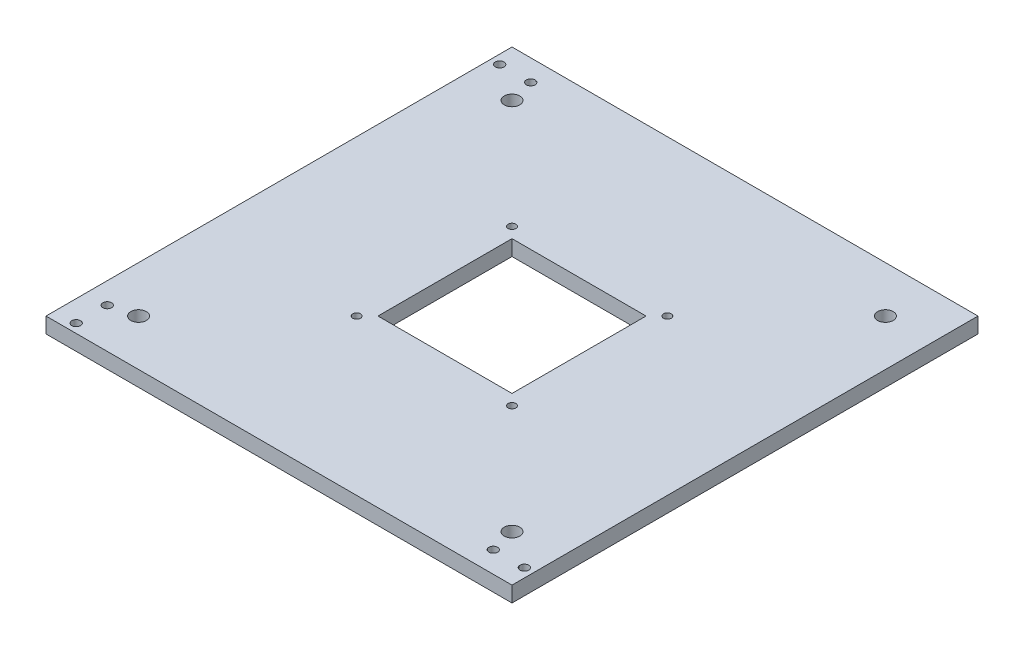
ISO-10303-21;
HEADER;
FILE_DESCRIPTION(('STEP AP214'),'2;1');
FILE_NAME('part.step','',(''),(''),'','','');
FILE_SCHEMA(('AUTOMOTIVE_DESIGN { 1 0 10303 214 1 1 1 1 }'));
ENDSEC;
DATA;
#1=APPLICATION_CONTEXT('core data for automotive mechanical design processes');
#2=APPLICATION_PROTOCOL_DEFINITION('international standard','automotive_design',2000,#1);
#3=PRODUCT_CONTEXT('',#1,'mechanical');
#4=PRODUCT('Part','Part','',(#3));
#5=PRODUCT_RELATED_PRODUCT_CATEGORY('part','',(#4));
#6=PRODUCT_DEFINITION_FORMATION('','',#4);
#7=PRODUCT_DEFINITION_CONTEXT('part definition',#1,'design');
#8=PRODUCT_DEFINITION('design','',#6,#7);
#9=PRODUCT_DEFINITION_SHAPE('','',#8);
#10=(LENGTH_UNIT() NAMED_UNIT(*) SI_UNIT(.MILLI.,.METRE.));
#11=(NAMED_UNIT(*) PLANE_ANGLE_UNIT() SI_UNIT($,.RADIAN.));
#12=(NAMED_UNIT(*) SI_UNIT($,.STERADIAN.) SOLID_ANGLE_UNIT());
#13=UNCERTAINTY_MEASURE_WITH_UNIT(LENGTH_MEASURE(1.E-05),#10,'distance_accuracy_value','');
#14=(GEOMETRIC_REPRESENTATION_CONTEXT(3) GLOBAL_UNCERTAINTY_ASSIGNED_CONTEXT((#13)) GLOBAL_UNIT_ASSIGNED_CONTEXT((#10,
#11,#12)) REPRESENTATION_CONTEXT('',''));
#15=CARTESIAN_POINT('',(0.,0.,0.));
#16=DIRECTION('',(0.,0.,1.));
#17=DIRECTION('',(1.,0.,0.));
#18=AXIS2_PLACEMENT_3D('',#15,#16,#17);
#19=CARTESIAN_POINT('',(0.,6.35,0.));
#20=DIRECTION('',(0.,1.,0.));
#21=DIRECTION('',(0.,0.,1.));
#22=AXIS2_PLACEMENT_3D('',#19,#20,#21);
#23=PLANE('',#22);
#24=CARTESIAN_POINT('',(-76.33,6.35,76.3299999999998));
#25=DIRECTION('',(0.,-1.,0.));
#26=DIRECTION('',(0.,0.,-1.));
#27=AXIS2_PLACEMENT_3D('',#24,#25,#26);
#28=CIRCLE('',#27,3.175);
#29=CARTESIAN_POINT('',(-76.33,6.35,73.1549999999998));
#30=VERTEX_POINT('',#29);
#31=EDGE_CURVE('E598',#30,#30,#28,.T.);
#32=ORIENTED_EDGE('',*,*,#31,.T.);
#33=EDGE_LOOP('',(#32));
#34=FACE_BOUND('',#33,.T.);
#35=CARTESIAN_POINT('',(-76.33,6.35,-76.3300000000002));
#36=DIRECTION('',(0.,-1.,0.));
#37=DIRECTION('',(0.,0.,-1.));
#38=AXIS2_PLACEMENT_3D('',#35,#36,#37);
#39=CIRCLE('',#38,3.175);
#40=CARTESIAN_POINT('',(-76.33,6.35,-79.5050000000002));
#41=VERTEX_POINT('',#40);
#42=EDGE_CURVE('E602',#41,#41,#39,.T.);
#43=ORIENTED_EDGE('',*,*,#42,.T.);
#44=EDGE_LOOP('',(#43));
#45=FACE_BOUND('',#44,.T.);
#46=CARTESIAN_POINT('',(76.3299999999999,6.35,76.3299999999997));
#47=DIRECTION('',(0.,-1.,0.));
#48=DIRECTION('',(0.,0.,-1.));
#49=AXIS2_PLACEMENT_3D('',#46,#47,#48);
#50=CIRCLE('',#49,3.175);
#51=CARTESIAN_POINT('',(76.3299999999999,6.35,73.1549999999997));
#52=VERTEX_POINT('',#51);
#53=EDGE_CURVE('E610',#52,#52,#50,.T.);
#54=ORIENTED_EDGE('',*,*,#53,.T.);
#55=EDGE_LOOP('',(#54));
#56=FACE_BOUND('',#55,.T.);
#57=CARTESIAN_POINT('',(76.3299999999999,6.35,-76.3300000000001));
#58=DIRECTION('',(0.,-1.,0.));
#59=DIRECTION('',(0.,0.,-1.));
#60=AXIS2_PLACEMENT_3D('',#57,#58,#59);
#61=CIRCLE('',#60,3.175);
#62=CARTESIAN_POINT('',(76.3299999999999,6.35,-79.5050000000001));
#63=VERTEX_POINT('',#62);
#64=EDGE_CURVE('E618',#63,#63,#61,.T.);
#65=ORIENTED_EDGE('',*,*,#64,.T.);
#66=EDGE_LOOP('',(#65));
#67=FACE_BOUND('',#66,.T.);
#68=CARTESIAN_POINT('',(31.7499999999999,6.35,-31.7499999999999));
#69=DIRECTION('',(0.,1.,0.));
#70=DIRECTION('',(0.,0.,1.));
#71=AXIS2_PLACEMENT_3D('',#68,#69,#70);
#72=CIRCLE('',#71,1.58749999999999);
#73=CARTESIAN_POINT('',(31.7499999999999,6.35,-30.1624999999999));
#74=VERTEX_POINT('',#73);
#75=EDGE_CURVE('E626',#74,#74,#72,.T.);
#76=ORIENTED_EDGE('',*,*,#75,.F.);
#77=EDGE_LOOP('',(#76));
#78=FACE_BOUND('',#77,.T.);
#79=CARTESIAN_POINT('',(-31.7500000000001,6.35,31.75));
#80=DIRECTION('',(0.,1.,0.));
#81=DIRECTION('',(0.,0.,1.));
#82=AXIS2_PLACEMENT_3D('',#79,#80,#81);
#83=CIRCLE('',#82,1.5875);
#84=CARTESIAN_POINT('',(-31.7500000000001,6.35,33.3375));
#85=VERTEX_POINT('',#84);
#86=EDGE_CURVE('E632',#85,#85,#83,.T.);
#87=ORIENTED_EDGE('',*,*,#86,.F.);
#88=EDGE_LOOP('',(#87));
#89=FACE_BOUND('',#88,.T.);
#90=CARTESIAN_POINT('',(-31.7500000000001,6.35,-31.75));
#91=DIRECTION('',(0.,1.,0.));
#92=DIRECTION('',(0.,0.,1.));
#93=AXIS2_PLACEMENT_3D('',#90,#91,#92);
#94=CIRCLE('',#93,1.5875);
#95=CARTESIAN_POINT('',(-31.7500000000001,6.35,-30.1625));
#96=VERTEX_POINT('',#95);
#97=EDGE_CURVE('E638',#96,#96,#94,.T.);
#98=ORIENTED_EDGE('',*,*,#97,.F.);
#99=EDGE_LOOP('',(#98));
#100=FACE_BOUND('',#99,.T.);
#101=CARTESIAN_POINT('',(31.7499999999998,6.35,31.75));
#102=DIRECTION('',(0.,1.,0.));
#103=DIRECTION('',(0.,0.,1.));
#104=AXIS2_PLACEMENT_3D('',#101,#102,#103);
#105=CIRCLE('',#104,1.58750000000001);
#106=CARTESIAN_POINT('',(31.7499999999998,6.35,33.3375));
#107=VERTEX_POINT('',#106);
#108=EDGE_CURVE('E269',#107,#107,#105,.T.);
#109=ORIENTED_EDGE('',*,*,#108,.F.);
#110=EDGE_LOOP('',(#109));
#111=FACE_BOUND('',#110,.T.);
#112=CARTESIAN_POINT('',(-91.6,6.35,-86.55));
#113=DIRECTION('',(0.,1.,0.));
#114=DIRECTION('',(0.,0.,1.));
#115=AXIS2_PLACEMENT_3D('',#112,#113,#114);
#116=CIRCLE('',#115,1.778);
#117=CARTESIAN_POINT('',(-91.6,6.35,-84.772));
#118=VERTEX_POINT('',#117);
#119=EDGE_CURVE('E291',#118,#118,#116,.T.);
#120=ORIENTED_EDGE('',*,*,#119,.F.);
#121=EDGE_LOOP('',(#120));
#122=FACE_BOUND('',#121,.T.);
#123=CARTESIAN_POINT('',(-86.55,6.35,91.6));
#124=DIRECTION('',(0.,1.,0.));
#125=DIRECTION('',(0.,0.,1.));
#126=AXIS2_PLACEMENT_3D('',#123,#124,#125);
#127=CIRCLE('',#126,1.778);
#128=CARTESIAN_POINT('',(-86.55,6.35,93.378));
#129=VERTEX_POINT('',#128);
#130=EDGE_CURVE('E303',#129,#129,#127,.T.);
#131=ORIENTED_EDGE('',*,*,#130,.F.);
#132=EDGE_LOOP('',(#131));
#133=FACE_BOUND('',#132,.T.);
#134=CARTESIAN_POINT('',(91.6,6.35,86.55));
#135=DIRECTION('',(0.,1.,0.));
#136=DIRECTION('',(0.,0.,1.));
#137=AXIS2_PLACEMENT_3D('',#134,#135,#136);
#138=CIRCLE('',#137,1.778);
#139=CARTESIAN_POINT('',(91.6,6.35,88.328));
#140=VERTEX_POINT('',#139);
#141=EDGE_CURVE('E315',#140,#140,#138,.T.);
#142=ORIENTED_EDGE('',*,*,#141,.F.);
#143=EDGE_LOOP('',(#142));
#144=FACE_BOUND('',#143,.T.);
#145=DIRECTION('',(1.,0.,0.));
#146=VECTOR('',#145,1.);
#147=CARTESIAN_POINT('',(-95.25,6.35,95.25));
#148=LINE('',#147,#146);
#149=CARTESIAN_POINT('',(-95.25,6.35,95.25));
#150=VERTEX_POINT('',#149);
#151=CARTESIAN_POINT('',(95.25,6.35,95.25));
#152=VERTEX_POINT('',#151);
#153=EDGE_CURVE('E327',#150,#152,#148,.T.);
#154=ORIENTED_EDGE('',*,*,#153,.T.);
#155=DIRECTION('',(0.,0.,-1.));
#156=VECTOR('',#155,1.);
#157=CARTESIAN_POINT('',(95.25,6.35,95.25));
#158=LINE('',#157,#156);
#159=CARTESIAN_POINT('',(95.25,6.35,-95.25));
#160=VERTEX_POINT('',#159);
#161=EDGE_CURVE('E330',#152,#160,#158,.T.);
#162=ORIENTED_EDGE('',*,*,#161,.T.);
#163=DIRECTION('',(1.,0.,0.));
#164=VECTOR('',#163,1.);
#165=CARTESIAN_POINT('',(-95.25,6.35,-95.25));
#166=LINE('',#165,#164);
#167=CARTESIAN_POINT('',(-95.25,6.35,-95.25));
#168=VERTEX_POINT('',#167);
#169=EDGE_CURVE('E333',#168,#160,#166,.T.);
#170=ORIENTED_EDGE('',*,*,#169,.F.);
#171=DIRECTION('',(0.,0.,-1.));
#172=VECTOR('',#171,1.);
#173=CARTESIAN_POINT('',(-95.25,6.35,95.25));
#174=LINE('',#173,#172);
#175=EDGE_CURVE('E336',#150,#168,#174,.T.);
#176=ORIENTED_EDGE('',*,*,#175,.F.);
#177=EDGE_LOOP('',(#154,#162,#170,#176));
#178=FACE_BOUND('',#177,.T.);
#179=CARTESIAN_POINT('',(78.9,6.35,86.55));
#180=DIRECTION('',(0.,1.,0.));
#181=DIRECTION('',(0.,0.,1.));
#182=AXIS2_PLACEMENT_3D('',#179,#180,#181);
#183=CIRCLE('',#182,1.778);
#184=CARTESIAN_POINT('',(78.9,6.35,88.328));
#185=VERTEX_POINT('',#184);
#186=EDGE_CURVE('E321',#185,#185,#183,.T.);
#187=ORIENTED_EDGE('',*,*,#186,.F.);
#188=EDGE_LOOP('',(#187));
#189=FACE_BOUND('',#188,.T.);
#190=CARTESIAN_POINT('',(-86.55,6.35,78.9));
#191=DIRECTION('',(0.,1.,0.));
#192=DIRECTION('',(0.,0.,1.));
#193=AXIS2_PLACEMENT_3D('',#190,#191,#192);
#194=CIRCLE('',#193,1.778);
#195=CARTESIAN_POINT('',(-86.55,6.35,80.678));
#196=VERTEX_POINT('',#195);
#197=EDGE_CURVE('E309',#196,#196,#194,.T.);
#198=ORIENTED_EDGE('',*,*,#197,.F.);
#199=EDGE_LOOP('',(#198));
#200=FACE_BOUND('',#199,.T.);
#201=CARTESIAN_POINT('',(-78.9,6.35,-86.55));
#202=DIRECTION('',(0.,1.,0.));
#203=DIRECTION('',(0.,0.,1.));
#204=AXIS2_PLACEMENT_3D('',#201,#202,#203);
#205=CIRCLE('',#204,1.778);
#206=CARTESIAN_POINT('',(-78.9,6.35,-84.772));
#207=VERTEX_POINT('',#206);
#208=EDGE_CURVE('E297',#207,#207,#205,.T.);
#209=ORIENTED_EDGE('',*,*,#208,.F.);
#210=EDGE_LOOP('',(#209));
#211=FACE_BOUND('',#210,.T.);
#212=DIRECTION('',(1.,0.,0.));
#213=VECTOR('',#212,1.);
#214=CARTESIAN_POINT('',(0.,6.35,-27.4));
#215=LINE('',#214,#213);
#216=CARTESIAN_POINT('',(-27.4000000000003,6.35,-27.4));
#217=VERTEX_POINT('',#216);
#218=CARTESIAN_POINT('',(27.3999999999997,6.35,-27.4));
#219=VERTEX_POINT('',#218);
#220=EDGE_CURVE('E287',#217,#219,#215,.T.);
#221=ORIENTED_EDGE('',*,*,#220,.T.);
#222=DIRECTION('',(0.,0.,1.));
#223=VECTOR('',#222,1.);
#224=CARTESIAN_POINT('',(27.3999999999997,6.35,0.));
#225=LINE('',#224,#223);
#226=CARTESIAN_POINT('',(27.3999999999997,6.35,27.4));
#227=VERTEX_POINT('',#226);
#228=EDGE_CURVE('E251',#219,#227,#225,.T.);
#229=ORIENTED_EDGE('',*,*,#228,.T.);
#230=DIRECTION('',(-1.,0.,0.));
#231=VECTOR('',#230,1.);
#232=CARTESIAN_POINT('',(0.,6.35,27.4));
#233=LINE('',#232,#231);
#234=CARTESIAN_POINT('',(-27.4000000000003,6.35,27.4));
#235=VERTEX_POINT('',#234);
#236=EDGE_CURVE('E254',#227,#235,#233,.T.);
#237=ORIENTED_EDGE('',*,*,#236,.T.);
#238=DIRECTION('',(0.,0.,-1.));
#239=VECTOR('',#238,1.);
#240=CARTESIAN_POINT('',(-27.4000000000003,6.35,0.));
#241=LINE('',#240,#239);
#242=EDGE_CURVE('E284',#235,#217,#241,.T.);
#243=ORIENTED_EDGE('',*,*,#242,.T.);
#244=EDGE_LOOP('',(#221,#229,#237,#243));
#245=FACE_BOUND('',#244,.T.);
#246=ADVANCED_FACE('F183',(#34,#45,#56,#67,#78,#89,#100,#111,#122,#133,#144,#178,#189,#200,#211,
#245),#23,.T.);
#247=CARTESIAN_POINT('',(0.,0.,0.));
#248=DIRECTION('',(0.,1.,0.));
#249=DIRECTION('',(0.,0.,1.));
#250=AXIS2_PLACEMENT_3D('',#247,#248,#249);
#251=PLANE('',#250);
#252=CARTESIAN_POINT('',(-76.33,0.,76.3299999999998));
#253=DIRECTION('',(0.,-1.,0.));
#254=DIRECTION('',(0.,0.,-1.));
#255=AXIS2_PLACEMENT_3D('',#252,#253,#254);
#256=CIRCLE('',#255,3.175);
#257=CARTESIAN_POINT('',(-76.33,0.,73.1549999999998));
#258=VERTEX_POINT('',#257);
#259=EDGE_CURVE('E601',#258,#258,#256,.T.);
#260=ORIENTED_EDGE('',*,*,#259,.F.);
#261=EDGE_LOOP('',(#260));
#262=FACE_BOUND('',#261,.T.);
#263=CARTESIAN_POINT('',(-76.33,0.,-76.3300000000002));
#264=DIRECTION('',(0.,-1.,0.));
#265=DIRECTION('',(0.,0.,-1.));
#266=AXIS2_PLACEMENT_3D('',#263,#264,#265);
#267=CIRCLE('',#266,3.175);
#268=CARTESIAN_POINT('',(-76.33,0.,-79.5050000000002));
#269=VERTEX_POINT('',#268);
#270=EDGE_CURVE('E605',#269,#269,#267,.T.);
#271=ORIENTED_EDGE('',*,*,#270,.F.);
#272=EDGE_LOOP('',(#271));
#273=FACE_BOUND('',#272,.T.);
#274=CARTESIAN_POINT('',(76.3299999999999,0.,76.3299999999997));
#275=DIRECTION('',(0.,-1.,0.));
#276=DIRECTION('',(0.,0.,-1.));
#277=AXIS2_PLACEMENT_3D('',#274,#275,#276);
#278=CIRCLE('',#277,3.175);
#279=CARTESIAN_POINT('',(76.3299999999999,0.,73.1549999999997));
#280=VERTEX_POINT('',#279);
#281=EDGE_CURVE('E612',#280,#280,#278,.T.);
#282=ORIENTED_EDGE('',*,*,#281,.F.);
#283=EDGE_LOOP('',(#282));
#284=FACE_BOUND('',#283,.T.);
#285=CARTESIAN_POINT('',(76.3299999999999,0.,-76.3300000000001));
#286=DIRECTION('',(0.,-1.,0.));
#287=DIRECTION('',(0.,0.,-1.));
#288=AXIS2_PLACEMENT_3D('',#285,#286,#287);
#289=CIRCLE('',#288,3.175);
#290=CARTESIAN_POINT('',(76.3299999999999,0.,-79.5050000000001));
#291=VERTEX_POINT('',#290);
#292=EDGE_CURVE('E615',#291,#291,#289,.T.);
#293=ORIENTED_EDGE('',*,*,#292,.F.);
#294=EDGE_LOOP('',(#293));
#295=FACE_BOUND('',#294,.T.);
#296=CARTESIAN_POINT('',(31.7499999999999,0.,-31.7499999999999));
#297=DIRECTION('',(0.,-1.,0.));
#298=DIRECTION('',(0.,0.,-1.));
#299=AXIS2_PLACEMENT_3D('',#296,#297,#298);
#300=CIRCLE('',#299,1.58749999999999);
#301=CARTESIAN_POINT('',(31.7499999999999,0.,-33.3374999999999));
#302=VERTEX_POINT('',#301);
#303=EDGE_CURVE('E621',#302,#302,#300,.T.);
#304=ORIENTED_EDGE('',*,*,#303,.F.);
#305=EDGE_LOOP('',(#304));
#306=FACE_BOUND('',#305,.T.);
#307=CARTESIAN_POINT('',(-31.7500000000001,0.,31.75));
#308=DIRECTION('',(0.,-1.,0.));
#309=DIRECTION('',(0.,0.,-1.));
#310=AXIS2_PLACEMENT_3D('',#307,#308,#309);
#311=CIRCLE('',#310,1.5875);
#312=CARTESIAN_POINT('',(-31.7500000000001,0.,30.1625));
#313=VERTEX_POINT('',#312);
#314=EDGE_CURVE('E629',#313,#313,#311,.T.);
#315=ORIENTED_EDGE('',*,*,#314,.F.);
#316=EDGE_LOOP('',(#315));
#317=FACE_BOUND('',#316,.T.);
#318=CARTESIAN_POINT('',(-31.7500000000001,0.,-31.75));
#319=DIRECTION('',(0.,-1.,0.));
#320=DIRECTION('',(0.,0.,-1.));
#321=AXIS2_PLACEMENT_3D('',#318,#319,#320);
#322=CIRCLE('',#321,1.5875);
#323=CARTESIAN_POINT('',(-31.7500000000001,0.,-33.3375));
#324=VERTEX_POINT('',#323);
#325=EDGE_CURVE('E635',#324,#324,#322,.T.);
#326=ORIENTED_EDGE('',*,*,#325,.F.);
#327=EDGE_LOOP('',(#326));
#328=FACE_BOUND('',#327,.T.);
#329=CARTESIAN_POINT('',(31.7499999999998,0.,31.75));
#330=DIRECTION('',(0.,-1.,0.));
#331=DIRECTION('',(0.,0.,-1.));
#332=AXIS2_PLACEMENT_3D('',#329,#330,#331);
#333=CIRCLE('',#332,1.58750000000001);
#334=CARTESIAN_POINT('',(31.7499999999998,0.,30.1625));
#335=VERTEX_POINT('',#334);
#336=EDGE_CURVE('E272',#335,#335,#333,.T.);
#337=ORIENTED_EDGE('',*,*,#336,.F.);
#338=EDGE_LOOP('',(#337));
#339=FACE_BOUND('',#338,.T.);
#340=CARTESIAN_POINT('',(-91.6,0.,-86.55));
#341=DIRECTION('',(0.,1.,0.));
#342=DIRECTION('',(0.,0.,1.));
#343=AXIS2_PLACEMENT_3D('',#340,#341,#342);
#344=CIRCLE('',#343,1.778);
#345=CARTESIAN_POINT('',(-91.6,0.,-84.772));
#346=VERTEX_POINT('',#345);
#347=EDGE_CURVE('E290',#346,#346,#344,.T.);
#348=ORIENTED_EDGE('',*,*,#347,.T.);
#349=EDGE_LOOP('',(#348));
#350=FACE_BOUND('',#349,.T.);
#351=CARTESIAN_POINT('',(-86.55,0.,91.6));
#352=DIRECTION('',(0.,1.,0.));
#353=DIRECTION('',(0.,0.,1.));
#354=AXIS2_PLACEMENT_3D('',#351,#352,#353);
#355=CIRCLE('',#354,1.778);
#356=CARTESIAN_POINT('',(-86.55,0.,93.378));
#357=VERTEX_POINT('',#356);
#358=EDGE_CURVE('E300',#357,#357,#355,.T.);
#359=ORIENTED_EDGE('',*,*,#358,.T.);
#360=EDGE_LOOP('',(#359));
#361=FACE_BOUND('',#360,.T.);
#362=CARTESIAN_POINT('',(91.6,0.,86.55));
#363=DIRECTION('',(0.,1.,0.));
#364=DIRECTION('',(0.,0.,1.));
#365=AXIS2_PLACEMENT_3D('',#362,#363,#364);
#366=CIRCLE('',#365,1.778);
#367=CARTESIAN_POINT('',(91.6,0.,88.328));
#368=VERTEX_POINT('',#367);
#369=EDGE_CURVE('E312',#368,#368,#366,.T.);
#370=ORIENTED_EDGE('',*,*,#369,.T.);
#371=EDGE_LOOP('',(#370));
#372=FACE_BOUND('',#371,.T.);
#373=DIRECTION('',(1.,0.,0.));
#374=VECTOR('',#373,1.);
#375=CARTESIAN_POINT('',(-95.25,0.,95.25));
#376=LINE('',#375,#374);
#377=CARTESIAN_POINT('',(-95.25,0.,95.25));
#378=VERTEX_POINT('',#377);
#379=CARTESIAN_POINT('',(95.25,0.,95.25));
#380=VERTEX_POINT('',#379);
#381=EDGE_CURVE('E324',#378,#380,#376,.T.);
#382=ORIENTED_EDGE('',*,*,#381,.F.);
#383=DIRECTION('',(0.,0.,-1.));
#384=VECTOR('',#383,1.);
#385=CARTESIAN_POINT('',(-95.25,0.,95.25));
#386=LINE('',#385,#384);
#387=CARTESIAN_POINT('',(-95.25,0.,-95.25));
#388=VERTEX_POINT('',#387);
#389=EDGE_CURVE('E331',#378,#388,#386,.T.);
#390=ORIENTED_EDGE('',*,*,#389,.T.);
#391=DIRECTION('',(1.,0.,0.));
#392=VECTOR('',#391,1.);
#393=CARTESIAN_POINT('',(-95.25,0.,-95.25));
#394=LINE('',#393,#392);
#395=CARTESIAN_POINT('',(95.25,0.,-95.25));
#396=VERTEX_POINT('',#395);
#397=EDGE_CURVE('E345',#388,#396,#394,.T.);
#398=ORIENTED_EDGE('',*,*,#397,.T.);
#399=DIRECTION('',(0.,0.,-1.));
#400=VECTOR('',#399,1.);
#401=CARTESIAN_POINT('',(95.25,0.,95.25));
#402=LINE('',#401,#400);
#403=EDGE_CURVE('E342',#380,#396,#402,.T.);
#404=ORIENTED_EDGE('',*,*,#403,.F.);
#405=EDGE_LOOP('',(#382,#390,#398,#404));
#406=FACE_BOUND('',#405,.T.);
#407=CARTESIAN_POINT('',(78.9,0.,86.55));
#408=DIRECTION('',(0.,1.,0.));
#409=DIRECTION('',(0.,0.,1.));
#410=AXIS2_PLACEMENT_3D('',#407,#408,#409);
#411=CIRCLE('',#410,1.778);
#412=CARTESIAN_POINT('',(78.9,0.,88.328));
#413=VERTEX_POINT('',#412);
#414=EDGE_CURVE('E318',#413,#413,#411,.T.);
#415=ORIENTED_EDGE('',*,*,#414,.T.);
#416=EDGE_LOOP('',(#415));
#417=FACE_BOUND('',#416,.T.);
#418=CARTESIAN_POINT('',(-86.55,0.,78.9));
#419=DIRECTION('',(0.,1.,0.));
#420=DIRECTION('',(0.,0.,1.));
#421=AXIS2_PLACEMENT_3D('',#418,#419,#420);
#422=CIRCLE('',#421,1.778);
#423=CARTESIAN_POINT('',(-86.55,0.,80.678));
#424=VERTEX_POINT('',#423);
#425=EDGE_CURVE('E306',#424,#424,#422,.T.);
#426=ORIENTED_EDGE('',*,*,#425,.T.);
#427=EDGE_LOOP('',(#426));
#428=FACE_BOUND('',#427,.T.);
#429=CARTESIAN_POINT('',(-78.9,0.,-86.55));
#430=DIRECTION('',(0.,1.,0.));
#431=DIRECTION('',(0.,0.,1.));
#432=AXIS2_PLACEMENT_3D('',#429,#430,#431);
#433=CIRCLE('',#432,1.778);
#434=CARTESIAN_POINT('',(-78.9,0.,-84.772));
#435=VERTEX_POINT('',#434);
#436=EDGE_CURVE('E294',#435,#435,#433,.T.);
#437=ORIENTED_EDGE('',*,*,#436,.T.);
#438=EDGE_LOOP('',(#437));
#439=FACE_BOUND('',#438,.T.);
#440=DIRECTION('',(0.,0.,-1.));
#441=VECTOR('',#440,1.);
#442=CARTESIAN_POINT('',(27.3999999999997,0.,27.4));
#443=LINE('',#442,#441);
#444=CARTESIAN_POINT('',(27.3999999999997,0.,27.4));
#445=VERTEX_POINT('',#444);
#446=CARTESIAN_POINT('',(27.3999999999997,0.,-27.4));
#447=VERTEX_POINT('',#446);
#448=EDGE_CURVE('E206',#445,#447,#443,.T.);
#449=ORIENTED_EDGE('',*,*,#448,.T.);
#450=DIRECTION('',(-1.,0.,0.));
#451=VECTOR('',#450,1.);
#452=CARTESIAN_POINT('',(27.3999999999997,0.,-27.4));
#453=LINE('',#452,#451);
#454=CARTESIAN_POINT('',(-27.4000000000003,0.,-27.4));
#455=VERTEX_POINT('',#454);
#456=EDGE_CURVE('E258',#447,#455,#453,.T.);
#457=ORIENTED_EDGE('',*,*,#456,.T.);
#458=DIRECTION('',(0.,0.,1.));
#459=VECTOR('',#458,1.);
#460=CARTESIAN_POINT('',(-27.4000000000003,0.,-27.4));
#461=LINE('',#460,#459);
#462=CARTESIAN_POINT('',(-27.4000000000003,0.,27.4));
#463=VERTEX_POINT('',#462);
#464=EDGE_CURVE('E264',#455,#463,#461,.T.);
#465=ORIENTED_EDGE('',*,*,#464,.T.);
#466=DIRECTION('',(1.,0.,0.));
#467=VECTOR('',#466,1.);
#468=CARTESIAN_POINT('',(-27.4000000000003,0.,27.4));
#469=LINE('',#468,#467);
#470=EDGE_CURVE('E268',#463,#445,#469,.T.);
#471=ORIENTED_EDGE('',*,*,#470,.T.);
#472=EDGE_LOOP('',(#449,#457,#465,#471));
#473=FACE_BOUND('',#472,.T.);
#474=ADVANCED_FACE('F267',(#262,#273,#284,#295,#306,#317,#328,#339,#350,#361,#372,#406,#417,
#428,#439,#473),#251,.F.);
#475=CARTESIAN_POINT('',(-95.25,6.35,95.25));
#476=DIRECTION('',(0.,0.,-1.));
#477=DIRECTION('',(-1.,0.,0.));
#478=AXIS2_PLACEMENT_3D('',#475,#476,#477);
#479=PLANE('',#478);
#480=ORIENTED_EDGE('',*,*,#381,.T.);
#481=DIRECTION('',(0.,-1.,0.));
#482=VECTOR('',#481,1.);
#483=CARTESIAN_POINT('',(95.25,6.35,95.25));
#484=LINE('',#483,#482);
#485=EDGE_CURVE('E12',#152,#380,#484,.T.);
#486=ORIENTED_EDGE('',*,*,#485,.F.);
#487=ORIENTED_EDGE('',*,*,#153,.F.);
#488=DIRECTION('',(0.,-1.,0.));
#489=VECTOR('',#488,1.);
#490=CARTESIAN_POINT('',(-95.25,6.35,95.25));
#491=LINE('',#490,#489);
#492=EDGE_CURVE('E339',#150,#378,#491,.T.);
#493=ORIENTED_EDGE('',*,*,#492,.T.);
#494=EDGE_LOOP('',(#480,#486,#487,#493));
#495=FACE_BOUND('',#494,.T.);
#496=ADVANCED_FACE('F185',(#495),#479,.F.);
#497=CARTESIAN_POINT('',(95.25,6.35,95.25));
#498=DIRECTION('',(-1.,0.,0.));
#499=DIRECTION('',(0.,0.,1.));
#500=AXIS2_PLACEMENT_3D('',#497,#498,#499);
#501=PLANE('',#500);
#502=ORIENTED_EDGE('',*,*,#403,.T.);
#503=DIRECTION('',(0.,-1.,0.));
#504=VECTOR('',#503,1.);
#505=CARTESIAN_POINT('',(95.25,6.35,-95.25));
#506=LINE('',#505,#504);
#507=EDGE_CURVE('E191',#160,#396,#506,.T.);
#508=ORIENTED_EDGE('',*,*,#507,.F.);
#509=ORIENTED_EDGE('',*,*,#161,.F.);
#510=ORIENTED_EDGE('',*,*,#485,.T.);
#511=EDGE_LOOP('',(#502,#508,#509,#510));
#512=FACE_BOUND('',#511,.T.);
#513=ADVANCED_FACE('F358',(#512),#501,.F.);
#514=CARTESIAN_POINT('',(-95.25,6.35,-95.25));
#515=DIRECTION('',(0.,0.,-1.));
#516=DIRECTION('',(-1.,0.,0.));
#517=AXIS2_PLACEMENT_3D('',#514,#515,#516);
#518=PLANE('',#517);
#519=ORIENTED_EDGE('',*,*,#397,.F.);
#520=DIRECTION('',(0.,-1.,0.));
#521=VECTOR('',#520,1.);
#522=CARTESIAN_POINT('',(-95.25,6.35,-95.25));
#523=LINE('',#522,#521);
#524=EDGE_CURVE('E351',#168,#388,#523,.T.);
#525=ORIENTED_EDGE('',*,*,#524,.F.);
#526=ORIENTED_EDGE('',*,*,#169,.T.);
#527=ORIENTED_EDGE('',*,*,#507,.T.);
#528=EDGE_LOOP('',(#519,#525,#526,#527));
#529=FACE_BOUND('',#528,.T.);
#530=ADVANCED_FACE('F355',(#529),#518,.T.);
#531=CARTESIAN_POINT('',(-95.25,6.35,95.25));
#532=DIRECTION('',(-1.,0.,0.));
#533=DIRECTION('',(0.,0.,1.));
#534=AXIS2_PLACEMENT_3D('',#531,#532,#533);
#535=PLANE('',#534);
#536=ORIENTED_EDGE('',*,*,#389,.F.);
#537=ORIENTED_EDGE('',*,*,#492,.F.);
#538=ORIENTED_EDGE('',*,*,#175,.T.);
#539=ORIENTED_EDGE('',*,*,#524,.T.);
#540=EDGE_LOOP('',(#536,#537,#538,#539));
#541=FACE_BOUND('',#540,.T.);
#542=ADVANCED_FACE('F365',(#541),#535,.T.);
#543=CARTESIAN_POINT('',(78.9,6.35,86.55));
#544=DIRECTION('',(0.,-1.,0.));
#545=DIRECTION('',(0.,0.,-1.));
#546=AXIS2_PLACEMENT_3D('',#543,#544,#545);
#547=CYLINDRICAL_SURFACE('',#546,1.778);
#548=ORIENTED_EDGE('',*,*,#186,.T.);
#549=EDGE_LOOP('',(#548));
#550=FACE_BOUND('',#549,.T.);
#551=ORIENTED_EDGE('',*,*,#414,.F.);
#552=EDGE_LOOP('',(#551));
#553=FACE_BOUND('',#552,.T.);
#554=ADVANCED_FACE('F388',(#550,#553),#547,.F.);
#555=CARTESIAN_POINT('',(91.6,6.35,86.55));
#556=DIRECTION('',(0.,-1.,0.));
#557=DIRECTION('',(0.,0.,-1.));
#558=AXIS2_PLACEMENT_3D('',#555,#556,#557);
#559=CYLINDRICAL_SURFACE('',#558,1.778);
#560=ORIENTED_EDGE('',*,*,#141,.T.);
#561=EDGE_LOOP('',(#560));
#562=FACE_BOUND('',#561,.T.);
#563=ORIENTED_EDGE('',*,*,#369,.F.);
#564=EDGE_LOOP('',(#563));
#565=FACE_BOUND('',#564,.T.);
#566=ADVANCED_FACE('F408',(#562,#565),#559,.F.);
#567=CARTESIAN_POINT('',(-86.55,6.35,78.9));
#568=DIRECTION('',(0.,-1.,0.));
#569=DIRECTION('',(0.,0.,-1.));
#570=AXIS2_PLACEMENT_3D('',#567,#568,#569);
#571=CYLINDRICAL_SURFACE('',#570,1.778);
#572=ORIENTED_EDGE('',*,*,#197,.T.);
#573=EDGE_LOOP('',(#572));
#574=FACE_BOUND('',#573,.T.);
#575=ORIENTED_EDGE('',*,*,#425,.F.);
#576=EDGE_LOOP('',(#575));
#577=FACE_BOUND('',#576,.T.);
#578=ADVANCED_FACE('F415',(#574,#577),#571,.F.);
#579=CARTESIAN_POINT('',(-86.55,6.35,91.6));
#580=DIRECTION('',(0.,-1.,0.));
#581=DIRECTION('',(0.,0.,-1.));
#582=AXIS2_PLACEMENT_3D('',#579,#580,#581);
#583=CYLINDRICAL_SURFACE('',#582,1.778);
#584=ORIENTED_EDGE('',*,*,#130,.T.);
#585=EDGE_LOOP('',(#584));
#586=FACE_BOUND('',#585,.T.);
#587=ORIENTED_EDGE('',*,*,#358,.F.);
#588=EDGE_LOOP('',(#587));
#589=FACE_BOUND('',#588,.T.);
#590=ADVANCED_FACE('F422',(#586,#589),#583,.F.);
#591=CARTESIAN_POINT('',(-78.9,6.35,-86.55));
#592=DIRECTION('',(0.,-1.,0.));
#593=DIRECTION('',(0.,0.,-1.));
#594=AXIS2_PLACEMENT_3D('',#591,#592,#593);
#595=CYLINDRICAL_SURFACE('',#594,1.778);
#596=ORIENTED_EDGE('',*,*,#208,.T.);
#597=EDGE_LOOP('',(#596));
#598=FACE_BOUND('',#597,.T.);
#599=ORIENTED_EDGE('',*,*,#436,.F.);
#600=EDGE_LOOP('',(#599));
#601=FACE_BOUND('',#600,.T.);
#602=ADVANCED_FACE('F430',(#598,#601),#595,.F.);
#603=CARTESIAN_POINT('',(-91.6,6.35,-86.55));
#604=DIRECTION('',(0.,-1.,0.));
#605=DIRECTION('',(0.,0.,-1.));
#606=AXIS2_PLACEMENT_3D('',#603,#604,#605);
#607=CYLINDRICAL_SURFACE('',#606,1.778);
#608=ORIENTED_EDGE('',*,*,#119,.T.);
#609=EDGE_LOOP('',(#608));
#610=FACE_BOUND('',#609,.T.);
#611=ORIENTED_EDGE('',*,*,#347,.F.);
#612=EDGE_LOOP('',(#611));
#613=FACE_BOUND('',#612,.T.);
#614=ADVANCED_FACE('F438',(#610,#613),#607,.F.);
#615=CARTESIAN_POINT('',(27.3999999999997,10.,27.4));
#616=DIRECTION('',(-1.,0.,0.));
#617=DIRECTION('',(0.,0.,1.));
#618=AXIS2_PLACEMENT_3D('',#615,#616,#617);
#619=PLANE('',#618);
#620=DIRECTION('',(0.,-1.,0.));
#621=VECTOR('',#620,1.);
#622=CARTESIAN_POINT('',(27.3999999999997,10.,-27.4));
#623=LINE('',#622,#621);
#624=EDGE_CURVE('E247',#219,#447,#623,.T.);
#625=ORIENTED_EDGE('',*,*,#624,.T.);
#626=ORIENTED_EDGE('',*,*,#448,.F.);
#627=DIRECTION('',(0.,-1.,0.));
#628=VECTOR('',#627,1.);
#629=CARTESIAN_POINT('',(27.3999999999997,10.,27.4));
#630=LINE('',#629,#628);
#631=EDGE_CURVE('E278',#227,#445,#630,.T.);
#632=ORIENTED_EDGE('',*,*,#631,.F.);
#633=ORIENTED_EDGE('',*,*,#228,.F.);
#634=EDGE_LOOP('',(#625,#626,#632,#633));
#635=FACE_BOUND('',#634,.T.);
#636=ADVANCED_FACE('F249',(#635),#619,.T.);
#637=CARTESIAN_POINT('',(27.3999999999997,10.,-27.4));
#638=DIRECTION('',(0.,0.,1.));
#639=DIRECTION('',(1.,0.,0.));
#640=AXIS2_PLACEMENT_3D('',#637,#638,#639);
#641=PLANE('',#640);
#642=DIRECTION('',(0.,-1.,0.));
#643=VECTOR('',#642,1.);
#644=CARTESIAN_POINT('',(-27.4000000000003,10.,-27.4));
#645=LINE('',#644,#643);
#646=EDGE_CURVE('E255',#217,#455,#645,.T.);
#647=ORIENTED_EDGE('',*,*,#646,.T.);
#648=ORIENTED_EDGE('',*,*,#456,.F.);
#649=ORIENTED_EDGE('',*,*,#624,.F.);
#650=ORIENTED_EDGE('',*,*,#220,.F.);
#651=EDGE_LOOP('',(#647,#648,#649,#650));
#652=FACE_BOUND('',#651,.T.);
#653=ADVANCED_FACE('F259',(#652),#641,.T.);
#654=CARTESIAN_POINT('',(-27.4000000000003,10.,-27.4));
#655=DIRECTION('',(1.,0.,0.));
#656=DIRECTION('',(0.,0.,-1.));
#657=AXIS2_PLACEMENT_3D('',#654,#655,#656);
#658=PLANE('',#657);
#659=DIRECTION('',(0.,-1.,0.));
#660=VECTOR('',#659,1.);
#661=CARTESIAN_POINT('',(-27.4000000000003,10.,27.4));
#662=LINE('',#661,#660);
#663=EDGE_CURVE('E198',#235,#463,#662,.T.);
#664=ORIENTED_EDGE('',*,*,#663,.T.);
#665=ORIENTED_EDGE('',*,*,#464,.F.);
#666=ORIENTED_EDGE('',*,*,#646,.F.);
#667=ORIENTED_EDGE('',*,*,#242,.F.);
#668=EDGE_LOOP('',(#664,#665,#666,#667));
#669=FACE_BOUND('',#668,.T.);
#670=ADVANCED_FACE('F459',(#669),#658,.T.);
#671=CARTESIAN_POINT('',(-27.4000000000003,10.,27.4));
#672=DIRECTION('',(0.,0.,-1.));
#673=DIRECTION('',(-1.,0.,0.));
#674=AXIS2_PLACEMENT_3D('',#671,#672,#673);
#675=PLANE('',#674);
#676=ORIENTED_EDGE('',*,*,#631,.T.);
#677=ORIENTED_EDGE('',*,*,#470,.F.);
#678=ORIENTED_EDGE('',*,*,#663,.F.);
#679=ORIENTED_EDGE('',*,*,#236,.F.);
#680=EDGE_LOOP('',(#676,#677,#678,#679));
#681=FACE_BOUND('',#680,.T.);
#682=ADVANCED_FACE('F466',(#681),#675,.T.);
#683=CARTESIAN_POINT('',(31.7499999999998,10.,31.75));
#684=DIRECTION('',(0.,-1.,0.));
#685=DIRECTION('',(0.,0.,-1.));
#686=AXIS2_PLACEMENT_3D('',#683,#684,#685);
#687=CYLINDRICAL_SURFACE('',#686,1.58750000000001);
#688=ORIENTED_EDGE('',*,*,#108,.T.);
#689=EDGE_LOOP('',(#688));
#690=FACE_BOUND('',#689,.T.);
#691=ORIENTED_EDGE('',*,*,#336,.T.);
#692=EDGE_LOOP('',(#691));
#693=FACE_BOUND('',#692,.T.);
#694=ADVANCED_FACE('F474',(#690,#693),#687,.F.);
#695=CARTESIAN_POINT('',(-31.7500000000001,10.,-31.75));
#696=DIRECTION('',(0.,-1.,0.));
#697=DIRECTION('',(0.,0.,-1.));
#698=AXIS2_PLACEMENT_3D('',#695,#696,#697);
#699=CYLINDRICAL_SURFACE('',#698,1.5875);
#700=ORIENTED_EDGE('',*,*,#97,.T.);
#701=EDGE_LOOP('',(#700));
#702=FACE_BOUND('',#701,.T.);
#703=ORIENTED_EDGE('',*,*,#325,.T.);
#704=EDGE_LOOP('',(#703));
#705=FACE_BOUND('',#704,.T.);
#706=ADVANCED_FACE('F481',(#702,#705),#699,.F.);
#707=CARTESIAN_POINT('',(-31.7500000000001,10.,31.75));
#708=DIRECTION('',(0.,-1.,0.));
#709=DIRECTION('',(0.,0.,-1.));
#710=AXIS2_PLACEMENT_3D('',#707,#708,#709);
#711=CYLINDRICAL_SURFACE('',#710,1.5875);
#712=ORIENTED_EDGE('',*,*,#86,.T.);
#713=EDGE_LOOP('',(#712));
#714=FACE_BOUND('',#713,.T.);
#715=ORIENTED_EDGE('',*,*,#314,.T.);
#716=EDGE_LOOP('',(#715));
#717=FACE_BOUND('',#716,.T.);
#718=ADVANCED_FACE('F489',(#714,#717),#711,.F.);
#719=CARTESIAN_POINT('',(31.7499999999999,10.,-31.7499999999999));
#720=DIRECTION('',(0.,-1.,0.));
#721=DIRECTION('',(0.,0.,-1.));
#722=AXIS2_PLACEMENT_3D('',#719,#720,#721);
#723=CYLINDRICAL_SURFACE('',#722,1.58749999999999);
#724=ORIENTED_EDGE('',*,*,#75,.T.);
#725=EDGE_LOOP('',(#724));
#726=FACE_BOUND('',#725,.T.);
#727=ORIENTED_EDGE('',*,*,#303,.T.);
#728=EDGE_LOOP('',(#727));
#729=FACE_BOUND('',#728,.T.);
#730=ADVANCED_FACE('F497',(#726,#729),#723,.F.);
#731=CARTESIAN_POINT('',(76.3299999999999,6.35,-76.3300000000001));
#732=DIRECTION('',(0.,-1.,0.));
#733=DIRECTION('',(0.,0.,-1.));
#734=AXIS2_PLACEMENT_3D('',#731,#732,#733);
#735=CYLINDRICAL_SURFACE('',#734,3.175);
#736=ORIENTED_EDGE('',*,*,#64,.F.);
#737=EDGE_LOOP('',(#736));
#738=FACE_BOUND('',#737,.T.);
#739=ORIENTED_EDGE('',*,*,#292,.T.);
#740=EDGE_LOOP('',(#739));
#741=FACE_BOUND('',#740,.T.);
#742=ADVANCED_FACE('F504',(#738,#741),#735,.F.);
#743=CARTESIAN_POINT('',(76.3299999999999,6.35,76.3299999999997));
#744=DIRECTION('',(0.,-1.,0.));
#745=DIRECTION('',(0.,0.,-1.));
#746=AXIS2_PLACEMENT_3D('',#743,#744,#745);
#747=CYLINDRICAL_SURFACE('',#746,3.175);
#748=ORIENTED_EDGE('',*,*,#53,.F.);
#749=EDGE_LOOP('',(#748));
#750=FACE_BOUND('',#749,.T.);
#751=ORIENTED_EDGE('',*,*,#281,.T.);
#752=EDGE_LOOP('',(#751));
#753=FACE_BOUND('',#752,.T.);
#754=ADVANCED_FACE('F512',(#750,#753),#747,.F.);
#755=CARTESIAN_POINT('',(-76.33,6.35,-76.3300000000002));
#756=DIRECTION('',(0.,-1.,0.));
#757=DIRECTION('',(0.,0.,-1.));
#758=AXIS2_PLACEMENT_3D('',#755,#756,#757);
#759=CYLINDRICAL_SURFACE('',#758,3.175);
#760=ORIENTED_EDGE('',*,*,#42,.F.);
#761=EDGE_LOOP('',(#760));
#762=FACE_BOUND('',#761,.T.);
#763=ORIENTED_EDGE('',*,*,#270,.T.);
#764=EDGE_LOOP('',(#763));
#765=FACE_BOUND('',#764,.T.);
#766=ADVANCED_FACE('F520',(#762,#765),#759,.F.);
#767=CARTESIAN_POINT('',(-76.33,6.35,76.3299999999998));
#768=DIRECTION('',(0.,-1.,0.));
#769=DIRECTION('',(0.,0.,-1.));
#770=AXIS2_PLACEMENT_3D('',#767,#768,#769);
#771=CYLINDRICAL_SURFACE('',#770,3.175);
#772=ORIENTED_EDGE('',*,*,#31,.F.);
#773=EDGE_LOOP('',(#772));
#774=FACE_BOUND('',#773,.T.);
#775=ORIENTED_EDGE('',*,*,#259,.T.);
#776=EDGE_LOOP('',(#775));
#777=FACE_BOUND('',#776,.T.);
#778=ADVANCED_FACE('F528',(#774,#777),#771,.F.);
#779=CLOSED_SHELL('',(#246,#474,#496,#513,#530,#542,#554,#566,#578,#590,#602,#614,#636,#653,
#670,#682,#694,#706,#718,#730,#742,#754,#766,#778));
#780=MANIFOLD_SOLID_BREP('B2',#779);
#781=ADVANCED_BREP_SHAPE_REPRESENTATION('',(#18,#780),#14);
#782=SHAPE_DEFINITION_REPRESENTATION(#9,#781);
ENDSEC;
END-ISO-10303-21;
